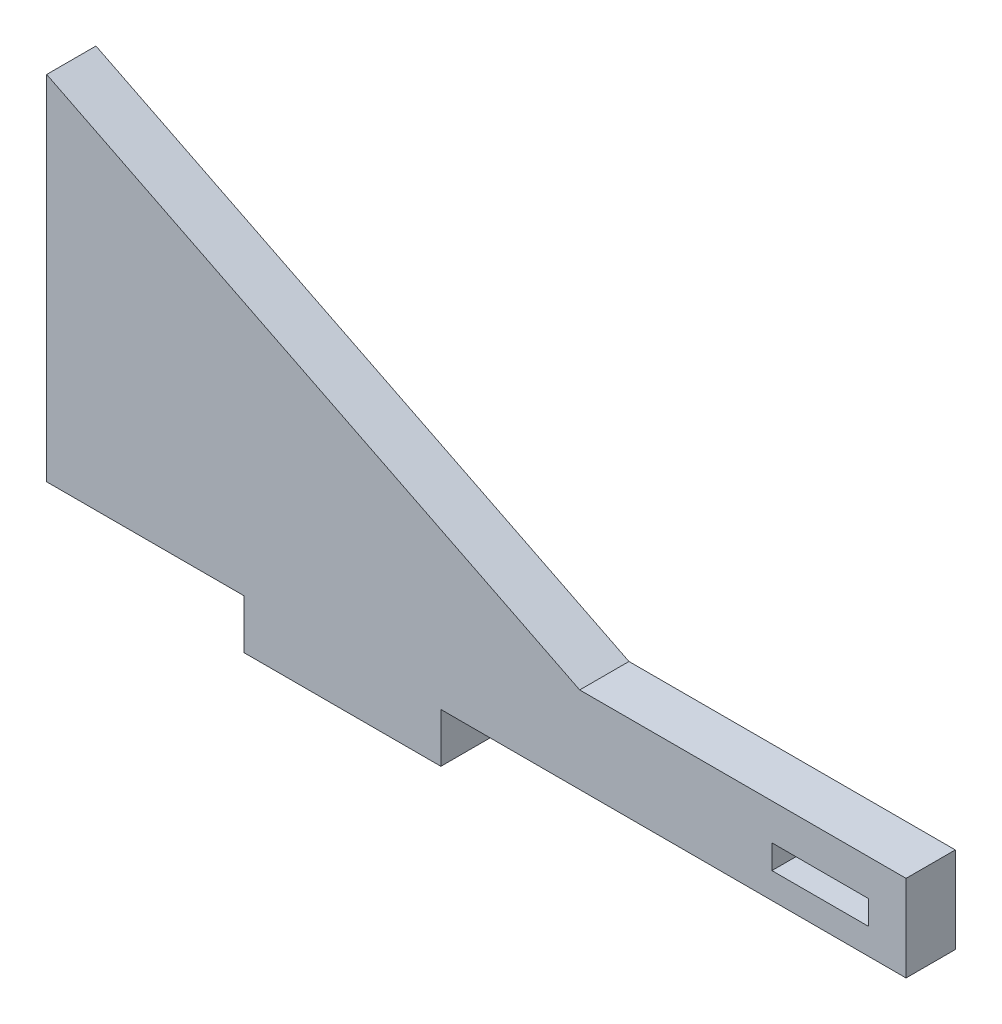
ISO-10303-21;
HEADER;
FILE_DESCRIPTION(('STEP AP214'),'2;1');
FILE_NAME('part.step','',(''),(''),'','','');
FILE_SCHEMA(('AUTOMOTIVE_DESIGN { 1 0 10303 214 1 1 1 1 }'));
ENDSEC;
DATA;
#1=APPLICATION_CONTEXT('core data for automotive mechanical design processes');
#2=APPLICATION_PROTOCOL_DEFINITION('international standard','automotive_design',2000,#1);
#3=PRODUCT_CONTEXT('',#1,'mechanical');
#4=PRODUCT('Part','Part','',(#3));
#5=PRODUCT_RELATED_PRODUCT_CATEGORY('part','',(#4));
#6=PRODUCT_DEFINITION_FORMATION('','',#4);
#7=PRODUCT_DEFINITION_CONTEXT('part definition',#1,'design');
#8=PRODUCT_DEFINITION('design','',#6,#7);
#9=PRODUCT_DEFINITION_SHAPE('','',#8);
#10=(LENGTH_UNIT() NAMED_UNIT(*) SI_UNIT(.MILLI.,.METRE.));
#11=(NAMED_UNIT(*) PLANE_ANGLE_UNIT() SI_UNIT($,.RADIAN.));
#12=(NAMED_UNIT(*) SI_UNIT($,.STERADIAN.) SOLID_ANGLE_UNIT());
#13=UNCERTAINTY_MEASURE_WITH_UNIT(LENGTH_MEASURE(1.E-05),#10,'distance_accuracy_value','');
#14=(GEOMETRIC_REPRESENTATION_CONTEXT(3) GLOBAL_UNCERTAINTY_ASSIGNED_CONTEXT((#13)) GLOBAL_UNIT_ASSIGNED_CONTEXT((#10,
#11,#12)) REPRESENTATION_CONTEXT('',''));
#15=CARTESIAN_POINT('',(0.,0.,0.));
#16=DIRECTION('',(0.,0.,1.));
#17=DIRECTION('',(1.,0.,0.));
#18=AXIS2_PLACEMENT_3D('',#15,#16,#17);
#19=CARTESIAN_POINT('',(-38.1,25.4,6.35));
#20=DIRECTION('',(1.,0.,0.));
#21=DIRECTION('',(0.,1.,0.));
#22=AXIS2_PLACEMENT_3D('',#19,#20,#21);
#23=PLANE('',#22);
#24=DIRECTION('',(0.,-1.,0.));
#25=VECTOR('',#24,1.);
#26=CARTESIAN_POINT('',(-38.1,25.4,0.));
#27=LINE('',#26,#25);
#28=CARTESIAN_POINT('',(-38.1,25.4,0.));
#29=VERTEX_POINT('',#28);
#30=CARTESIAN_POINT('',(-38.1,-20.066,0.));
#31=VERTEX_POINT('',#30);
#32=EDGE_CURVE('E177',#29,#31,#27,.T.);
#33=ORIENTED_EDGE('',*,*,#32,.T.);
#34=DIRECTION('',(0.,0.,-1.));
#35=VECTOR('',#34,1.);
#36=CARTESIAN_POINT('',(-38.1,-20.066,6.35));
#37=LINE('',#36,#35);
#38=CARTESIAN_POINT('',(-38.1,-20.066,6.35));
#39=VERTEX_POINT('',#38);
#40=EDGE_CURVE('E11',#39,#31,#37,.T.);
#41=ORIENTED_EDGE('',*,*,#40,.F.);
#42=DIRECTION('',(0.,-1.,0.));
#43=VECTOR('',#42,1.);
#44=CARTESIAN_POINT('',(-38.1,25.4,6.35));
#45=LINE('',#44,#43);
#46=CARTESIAN_POINT('',(-38.1,25.4,6.35));
#47=VERTEX_POINT('',#46);
#48=EDGE_CURVE('E182',#47,#39,#45,.T.);
#49=ORIENTED_EDGE('',*,*,#48,.F.);
#50=DIRECTION('',(0.,0.,-1.));
#51=VECTOR('',#50,1.);
#52=CARTESIAN_POINT('',(-38.1,25.4,6.35));
#53=LINE('',#52,#51);
#54=EDGE_CURVE('E198',#47,#29,#53,.T.);
#55=ORIENTED_EDGE('',*,*,#54,.T.);
#56=EDGE_LOOP('',(#33,#41,#49,#55));
#57=FACE_BOUND('',#56,.T.);
#58=ADVANCED_FACE('F32',(#57),#23,.F.);
#59=CARTESIAN_POINT('',(-38.1,-20.066,6.35));
#60=DIRECTION('',(0.,1.,0.));
#61=DIRECTION('',(0.,0.,1.));
#62=AXIS2_PLACEMENT_3D('',#59,#60,#61);
#63=PLANE('',#62);
#64=DIRECTION('',(1.,0.,0.));
#65=VECTOR('',#64,1.);
#66=CARTESIAN_POINT('',(-38.1,-20.066,0.));
#67=LINE('',#66,#65);
#68=CARTESIAN_POINT('',(-12.7,-20.066,0.));
#69=VERTEX_POINT('',#68);
#70=EDGE_CURVE('E201',#31,#69,#67,.T.);
#71=ORIENTED_EDGE('',*,*,#70,.T.);
#72=DIRECTION('',(0.,0.,-1.));
#73=VECTOR('',#72,1.);
#74=CARTESIAN_POINT('',(-12.7,-20.066,6.35));
#75=LINE('',#74,#73);
#76=CARTESIAN_POINT('',(-12.7,-20.066,6.35));
#77=VERTEX_POINT('',#76);
#78=EDGE_CURVE('E39',#77,#69,#75,.T.);
#79=ORIENTED_EDGE('',*,*,#78,.F.);
#80=DIRECTION('',(1.,0.,0.));
#81=VECTOR('',#80,1.);
#82=CARTESIAN_POINT('',(-38.1,-20.066,6.35));
#83=LINE('',#82,#81);
#84=EDGE_CURVE('E185',#39,#77,#83,.T.);
#85=ORIENTED_EDGE('',*,*,#84,.F.);
#86=ORIENTED_EDGE('',*,*,#40,.T.);
#87=EDGE_LOOP('',(#71,#79,#85,#86));
#88=FACE_BOUND('',#87,.T.);
#89=ADVANCED_FACE('F248',(#88),#63,.F.);
#90=CARTESIAN_POINT('',(-12.7,-20.066,6.35));
#91=DIRECTION('',(1.,0.,0.));
#92=DIRECTION('',(0.,1.,0.));
#93=AXIS2_PLACEMENT_3D('',#90,#91,#92);
#94=PLANE('',#93);
#95=DIRECTION('',(0.,-1.,0.));
#96=VECTOR('',#95,1.);
#97=CARTESIAN_POINT('',(-12.7,-20.066,0.));
#98=LINE('',#97,#96);
#99=CARTESIAN_POINT('',(-12.7,-26.416,0.));
#100=VERTEX_POINT('',#99);
#101=EDGE_CURVE('E203',#69,#100,#98,.T.);
#102=ORIENTED_EDGE('',*,*,#101,.T.);
#103=DIRECTION('',(0.,0.,-1.));
#104=VECTOR('',#103,1.);
#105=CARTESIAN_POINT('',(-12.7,-26.416,6.35));
#106=LINE('',#105,#104);
#107=CARTESIAN_POINT('',(-12.7,-26.416,6.35));
#108=VERTEX_POINT('',#107);
#109=EDGE_CURVE('E220',#108,#100,#106,.T.);
#110=ORIENTED_EDGE('',*,*,#109,.F.);
#111=DIRECTION('',(0.,-1.,0.));
#112=VECTOR('',#111,1.);
#113=CARTESIAN_POINT('',(-12.7,-20.066,6.35));
#114=LINE('',#113,#112);
#115=EDGE_CURVE('E188',#77,#108,#114,.T.);
#116=ORIENTED_EDGE('',*,*,#115,.F.);
#117=ORIENTED_EDGE('',*,*,#78,.T.);
#118=EDGE_LOOP('',(#102,#110,#116,#117));
#119=FACE_BOUND('',#118,.T.);
#120=ADVANCED_FACE('F227',(#119),#94,.F.);
#121=CARTESIAN_POINT('',(12.7,-26.416,6.35));
#122=DIRECTION('',(0.,1.,0.));
#123=DIRECTION('',(0.,0.,1.));
#124=AXIS2_PLACEMENT_3D('',#121,#122,#123);
#125=PLANE('',#124);
#126=DIRECTION('',(1.,0.,0.));
#127=VECTOR('',#126,1.);
#128=CARTESIAN_POINT('',(12.7,-26.416,0.));
#129=LINE('',#128,#127);
#130=CARTESIAN_POINT('',(12.7,-26.416,0.));
#131=VERTEX_POINT('',#130);
#132=EDGE_CURVE('E205',#100,#131,#129,.T.);
#133=ORIENTED_EDGE('',*,*,#132,.T.);
#134=DIRECTION('',(0.,0.,-1.));
#135=VECTOR('',#134,1.);
#136=CARTESIAN_POINT('',(12.7,-26.416,6.35));
#137=LINE('',#136,#135);
#138=CARTESIAN_POINT('',(12.7,-26.416,6.35));
#139=VERTEX_POINT('',#138);
#140=EDGE_CURVE('E217',#139,#131,#137,.T.);
#141=ORIENTED_EDGE('',*,*,#140,.F.);
#142=DIRECTION('',(1.,0.,0.));
#143=VECTOR('',#142,1.);
#144=CARTESIAN_POINT('',(12.7,-26.416,6.35));
#145=LINE('',#144,#143);
#146=EDGE_CURVE('E190',#108,#139,#145,.T.);
#147=ORIENTED_EDGE('',*,*,#146,.F.);
#148=ORIENTED_EDGE('',*,*,#109,.T.);
#149=EDGE_LOOP('',(#133,#141,#147,#148));
#150=FACE_BOUND('',#149,.T.);
#151=ADVANCED_FACE('F238',(#150),#125,.F.);
#152=CARTESIAN_POINT('',(12.7,-20.066,6.35));
#153=DIRECTION('',(-1.,0.,0.));
#154=DIRECTION('',(0.,-1.,0.));
#155=AXIS2_PLACEMENT_3D('',#152,#153,#154);
#156=PLANE('',#155);
#157=DIRECTION('',(0.,1.,0.));
#158=VECTOR('',#157,1.);
#159=CARTESIAN_POINT('',(12.7,-20.066,0.));
#160=LINE('',#159,#158);
#161=CARTESIAN_POINT('',(12.7,-20.066,0.));
#162=VERTEX_POINT('',#161);
#163=EDGE_CURVE('E207',#131,#162,#160,.T.);
#164=ORIENTED_EDGE('',*,*,#163,.T.);
#165=DIRECTION('',(0.,0.,-1.));
#166=VECTOR('',#165,1.);
#167=CARTESIAN_POINT('',(12.7,-20.066,6.35));
#168=LINE('',#167,#166);
#169=CARTESIAN_POINT('',(12.7,-20.066,6.35));
#170=VERTEX_POINT('',#169);
#171=EDGE_CURVE('E214',#170,#162,#168,.T.);
#172=ORIENTED_EDGE('',*,*,#171,.F.);
#173=DIRECTION('',(0.,1.,0.));
#174=VECTOR('',#173,1.);
#175=CARTESIAN_POINT('',(12.7,-20.066,6.35));
#176=LINE('',#175,#174);
#177=EDGE_CURVE('E192',#139,#170,#176,.T.);
#178=ORIENTED_EDGE('',*,*,#177,.F.);
#179=ORIENTED_EDGE('',*,*,#140,.T.);
#180=EDGE_LOOP('',(#164,#172,#178,#179));
#181=FACE_BOUND('',#180,.T.);
#182=ADVANCED_FACE('F242',(#181),#156,.F.);
#183=CARTESIAN_POINT('',(12.7,-20.066,6.35));
#184=DIRECTION('',(0.,1.,0.));
#185=DIRECTION('',(0.,0.,1.));
#186=AXIS2_PLACEMENT_3D('',#183,#184,#185);
#187=PLANE('',#186);
#188=DIRECTION('',(1.,0.,0.));
#189=VECTOR('',#188,1.);
#190=CARTESIAN_POINT('',(12.7,-20.066,0.));
#191=LINE('',#190,#189);
#192=CARTESIAN_POINT('',(72.644,-20.066,0.));
#193=VERTEX_POINT('',#192);
#194=EDGE_CURVE('E209',#162,#193,#191,.T.);
#195=ORIENTED_EDGE('',*,*,#194,.T.);
#196=DIRECTION('',(0.,0.,1.));
#197=VECTOR('',#196,1.);
#198=CARTESIAN_POINT('',(72.644,-20.066,0.));
#199=LINE('',#198,#197);
#200=CARTESIAN_POINT('',(72.644,-20.066,6.35));
#201=VERTEX_POINT('',#200);
#202=EDGE_CURVE('E169',#193,#201,#199,.T.);
#203=ORIENTED_EDGE('',*,*,#202,.T.);
#204=DIRECTION('',(1.,0.,0.));
#205=VECTOR('',#204,1.);
#206=CARTESIAN_POINT('',(12.7,-20.066,6.35));
#207=LINE('',#206,#205);
#208=EDGE_CURVE('E194',#170,#201,#207,.T.);
#209=ORIENTED_EDGE('',*,*,#208,.F.);
#210=ORIENTED_EDGE('',*,*,#171,.T.);
#211=EDGE_LOOP('',(#195,#203,#209,#210));
#212=FACE_BOUND('',#211,.T.);
#213=ADVANCED_FACE('F264',(#212),#187,.F.);
#214=CARTESIAN_POINT('',(-38.1,25.4,6.35));
#215=DIRECTION('',(-0.447213595499958,-0.894427190999916,0.));
#216=DIRECTION('',(0.894427190999916,-0.447213595499958,0.));
#217=AXIS2_PLACEMENT_3D('',#214,#215,#216);
#218=PLANE('',#217);
#219=DIRECTION('',(-0.894427190999916,0.447213595499958,0.));
#220=VECTOR('',#219,1.);
#221=CARTESIAN_POINT('',(-38.1,25.4,6.35));
#222=LINE('',#221,#220);
#223=CARTESIAN_POINT('',(30.588537433123,-8.94426871656152,6.35));
#224=VERTEX_POINT('',#223);
#225=EDGE_CURVE('E196',#224,#47,#222,.T.);
#226=ORIENTED_EDGE('',*,*,#225,.F.);
#227=DIRECTION('',(0.,0.,1.));
#228=VECTOR('',#227,1.);
#229=CARTESIAN_POINT('',(30.5885374331231,-8.94426871656151,0.));
#230=LINE('',#229,#228);
#231=CARTESIAN_POINT('',(30.5885374331231,-8.94426871656151,0.));
#232=VERTEX_POINT('',#231);
#233=EDGE_CURVE('E174',#232,#224,#230,.T.);
#234=ORIENTED_EDGE('',*,*,#233,.F.);
#235=DIRECTION('',(-0.894427190999916,0.447213595499958,0.));
#236=VECTOR('',#235,1.);
#237=CARTESIAN_POINT('',(-38.1,25.4,0.));
#238=LINE('',#237,#236);
#239=EDGE_CURVE('E186',#232,#29,#238,.T.);
#240=ORIENTED_EDGE('',*,*,#239,.T.);
#241=ORIENTED_EDGE('',*,*,#54,.F.);
#242=EDGE_LOOP('',(#226,#234,#240,#241));
#243=FACE_BOUND('',#242,.T.);
#244=ADVANCED_FACE('F255',(#243),#218,.F.);
#245=CARTESIAN_POINT('',(-38.1,-20.066,6.35));
#246=DIRECTION('',(0.,0.,1.));
#247=DIRECTION('',(1.,0.,0.));
#248=AXIS2_PLACEMENT_3D('',#245,#246,#247);
#249=PLANE('',#248);
#250=DIRECTION('',(0.,-1.,0.));
#251=VECTOR('',#250,1.);
#252=CARTESIAN_POINT('',(67.7758241726849,-16.7235443464116,6.35));
#253=LINE('',#252,#251);
#254=CARTESIAN_POINT('',(67.7758241726849,-13.6212454686131,6.35));
#255=VERTEX_POINT('',#254);
#256=CARTESIAN_POINT('',(67.7758241726849,-16.7235443464116,6.35));
#257=VERTEX_POINT('',#256);
#258=EDGE_CURVE('E128',#255,#257,#253,.T.);
#259=ORIENTED_EDGE('',*,*,#258,.T.);
#260=DIRECTION('',(-1.,0.,0.));
#261=VECTOR('',#260,1.);
#262=CARTESIAN_POINT('',(67.7758241726849,-16.7235443464116,6.35));
#263=LINE('',#262,#261);
#264=CARTESIAN_POINT('',(55.3561243607419,-16.7235443464116,6.35));
#265=VERTEX_POINT('',#264);
#266=EDGE_CURVE('E137',#257,#265,#263,.T.);
#267=ORIENTED_EDGE('',*,*,#266,.T.);
#268=DIRECTION('',(0.,1.,0.));
#269=VECTOR('',#268,1.);
#270=CARTESIAN_POINT('',(55.3561243607419,-16.7235443464116,6.35));
#271=LINE('',#270,#269);
#272=CARTESIAN_POINT('',(55.3561243607419,-13.6212454686131,6.35));
#273=VERTEX_POINT('',#272);
#274=EDGE_CURVE('E46',#265,#273,#271,.T.);
#275=ORIENTED_EDGE('',*,*,#274,.T.);
#276=DIRECTION('',(1.,0.,0.));
#277=VECTOR('',#276,1.);
#278=CARTESIAN_POINT('',(67.7758241726849,-13.6212454686131,6.35));
#279=LINE('',#278,#277);
#280=EDGE_CURVE('E134',#273,#255,#279,.T.);
#281=ORIENTED_EDGE('',*,*,#280,.T.);
#282=EDGE_LOOP('',(#259,#267,#275,#281));
#283=FACE_BOUND('',#282,.T.);
#284=ORIENTED_EDGE('',*,*,#48,.T.);
#285=ORIENTED_EDGE('',*,*,#84,.T.);
#286=ORIENTED_EDGE('',*,*,#115,.T.);
#287=ORIENTED_EDGE('',*,*,#146,.T.);
#288=ORIENTED_EDGE('',*,*,#177,.T.);
#289=ORIENTED_EDGE('',*,*,#208,.T.);
#290=DIRECTION('',(0.,1.,0.));
#291=VECTOR('',#290,1.);
#292=CARTESIAN_POINT('',(72.644,-12.7,6.35));
#293=LINE('',#292,#291);
#294=CARTESIAN_POINT('',(72.644,-8.94426871656151,6.35));
#295=VERTEX_POINT('',#294);
#296=EDGE_CURVE('E159',#201,#295,#293,.T.);
#297=ORIENTED_EDGE('',*,*,#296,.T.);
#298=DIRECTION('',(-1.,0.,0.));
#299=VECTOR('',#298,1.);
#300=CARTESIAN_POINT('',(30.5885374331231,-8.94426871656151,6.35));
#301=LINE('',#300,#299);
#302=EDGE_CURVE('E166',#295,#224,#301,.T.);
#303=ORIENTED_EDGE('',*,*,#302,.T.);
#304=ORIENTED_EDGE('',*,*,#225,.T.);
#305=EDGE_LOOP('',(#284,#285,#286,#287,#288,#289,#297,#303,#304));
#306=FACE_BOUND('',#305,.T.);
#307=ADVANCED_FACE('F141',(#283,#306),#249,.T.);
#308=CARTESIAN_POINT('',(-38.1,-20.066,0.));
#309=DIRECTION('',(0.,0.,1.));
#310=DIRECTION('',(1.,0.,0.));
#311=AXIS2_PLACEMENT_3D('',#308,#309,#310);
#312=PLANE('',#311);
#313=DIRECTION('',(-1.,0.,0.));
#314=VECTOR('',#313,1.);
#315=CARTESIAN_POINT('',(67.7758241726849,-16.7235443464116,0.));
#316=LINE('',#315,#314);
#317=CARTESIAN_POINT('',(67.7758241726849,-16.7235443464116,0.));
#318=VERTEX_POINT('',#317);
#319=CARTESIAN_POINT('',(55.3561243607419,-16.7235443464116,0.));
#320=VERTEX_POINT('',#319);
#321=EDGE_CURVE('E153',#318,#320,#316,.T.);
#322=ORIENTED_EDGE('',*,*,#321,.F.);
#323=DIRECTION('',(0.,-1.,0.));
#324=VECTOR('',#323,1.);
#325=CARTESIAN_POINT('',(67.7758241726849,-16.7235443464116,0.));
#326=LINE('',#325,#324);
#327=CARTESIAN_POINT('',(67.7758241726849,-13.6212454686131,0.));
#328=VERTEX_POINT('',#327);
#329=EDGE_CURVE('E54',#328,#318,#326,.T.);
#330=ORIENTED_EDGE('',*,*,#329,.F.);
#331=DIRECTION('',(1.,0.,0.));
#332=VECTOR('',#331,1.);
#333=CARTESIAN_POINT('',(67.7758241726849,-13.6212454686131,0.));
#334=LINE('',#333,#332);
#335=CARTESIAN_POINT('',(55.3561243607419,-13.6212454686131,0.));
#336=VERTEX_POINT('',#335);
#337=EDGE_CURVE('E144',#336,#328,#334,.T.);
#338=ORIENTED_EDGE('',*,*,#337,.F.);
#339=DIRECTION('',(0.,1.,0.));
#340=VECTOR('',#339,1.);
#341=CARTESIAN_POINT('',(55.3561243607419,-16.7235443464116,0.));
#342=LINE('',#341,#340);
#343=EDGE_CURVE('E147',#320,#336,#342,.T.);
#344=ORIENTED_EDGE('',*,*,#343,.F.);
#345=EDGE_LOOP('',(#322,#330,#338,#344));
#346=FACE_BOUND('',#345,.T.);
#347=ORIENTED_EDGE('',*,*,#32,.F.);
#348=ORIENTED_EDGE('',*,*,#239,.F.);
#349=DIRECTION('',(-1.,0.,0.));
#350=VECTOR('',#349,1.);
#351=CARTESIAN_POINT('',(30.5885374331231,-8.94426871656151,0.));
#352=LINE('',#351,#350);
#353=CARTESIAN_POINT('',(72.644,-8.94426871656151,0.));
#354=VERTEX_POINT('',#353);
#355=EDGE_CURVE('E165',#354,#232,#352,.T.);
#356=ORIENTED_EDGE('',*,*,#355,.F.);
#357=DIRECTION('',(0.,1.,0.));
#358=VECTOR('',#357,1.);
#359=CARTESIAN_POINT('',(72.644,-20.066,0.));
#360=LINE('',#359,#358);
#361=EDGE_CURVE('E163',#193,#354,#360,.T.);
#362=ORIENTED_EDGE('',*,*,#361,.F.);
#363=ORIENTED_EDGE('',*,*,#194,.F.);
#364=ORIENTED_EDGE('',*,*,#163,.F.);
#365=ORIENTED_EDGE('',*,*,#132,.F.);
#366=ORIENTED_EDGE('',*,*,#101,.F.);
#367=ORIENTED_EDGE('',*,*,#70,.F.);
#368=EDGE_LOOP('',(#347,#348,#356,#362,#363,#364,#365,#366,#367));
#369=FACE_BOUND('',#368,.T.);
#370=ADVANCED_FACE('F233',(#346,#369),#312,.F.);
#371=CARTESIAN_POINT('',(30.5885374331231,-8.94426871656151,0.));
#372=DIRECTION('',(0.,1.,0.));
#373=DIRECTION('',(-1.,0.,0.));
#374=AXIS2_PLACEMENT_3D('',#371,#372,#373);
#375=PLANE('',#374);
#376=ORIENTED_EDGE('',*,*,#302,.F.);
#377=DIRECTION('',(0.,0.,1.));
#378=VECTOR('',#377,1.);
#379=CARTESIAN_POINT('',(72.644,-8.94426871656151,0.));
#380=LINE('',#379,#378);
#381=EDGE_CURVE('E178',#354,#295,#380,.T.);
#382=ORIENTED_EDGE('',*,*,#381,.F.);
#383=ORIENTED_EDGE('',*,*,#355,.T.);
#384=ORIENTED_EDGE('',*,*,#233,.T.);
#385=EDGE_LOOP('',(#376,#382,#383,#384));
#386=FACE_BOUND('',#385,.T.);
#387=ADVANCED_FACE('F259',(#386),#375,.T.);
#388=CARTESIAN_POINT('',(72.644,-12.7,0.));
#389=DIRECTION('',(1.,0.,0.));
#390=DIRECTION('',(0.,0.,-1.));
#391=AXIS2_PLACEMENT_3D('',#388,#389,#390);
#392=PLANE('',#391);
#393=ORIENTED_EDGE('',*,*,#296,.F.);
#394=ORIENTED_EDGE('',*,*,#202,.F.);
#395=ORIENTED_EDGE('',*,*,#361,.T.);
#396=ORIENTED_EDGE('',*,*,#381,.T.);
#397=EDGE_LOOP('',(#393,#394,#395,#396));
#398=FACE_BOUND('',#397,.T.);
#399=ADVANCED_FACE('F261',(#398),#392,.T.);
#400=CARTESIAN_POINT('',(67.7758241726849,-16.7235443464116,6.35));
#401=DIRECTION('',(1.,0.,0.));
#402=DIRECTION('',(0.,0.,-1.));
#403=AXIS2_PLACEMENT_3D('',#400,#401,#402);
#404=PLANE('',#403);
#405=ORIENTED_EDGE('',*,*,#329,.T.);
#406=DIRECTION('',(0.,0.,-1.));
#407=VECTOR('',#406,1.);
#408=CARTESIAN_POINT('',(67.7758241726849,-16.7235443464116,6.35));
#409=LINE('',#408,#407);
#410=EDGE_CURVE('E124',#257,#318,#409,.T.);
#411=ORIENTED_EDGE('',*,*,#410,.F.);
#412=ORIENTED_EDGE('',*,*,#258,.F.);
#413=DIRECTION('',(0.,0.,-1.));
#414=VECTOR('',#413,1.);
#415=CARTESIAN_POINT('',(67.7758241726849,-13.6212454686131,6.35));
#416=LINE('',#415,#414);
#417=EDGE_CURVE('E157',#255,#328,#416,.T.);
#418=ORIENTED_EDGE('',*,*,#417,.T.);
#419=EDGE_LOOP('',(#405,#411,#412,#418));
#420=FACE_BOUND('',#419,.T.);
#421=ADVANCED_FACE('F126',(#420),#404,.F.);
#422=CARTESIAN_POINT('',(67.7758241726849,-13.6212454686131,6.35));
#423=DIRECTION('',(0.,1.,0.));
#424=DIRECTION('',(0.,0.,1.));
#425=AXIS2_PLACEMENT_3D('',#422,#423,#424);
#426=PLANE('',#425);
#427=ORIENTED_EDGE('',*,*,#337,.T.);
#428=ORIENTED_EDGE('',*,*,#417,.F.);
#429=ORIENTED_EDGE('',*,*,#280,.F.);
#430=DIRECTION('',(0.,0.,-1.));
#431=VECTOR('',#430,1.);
#432=CARTESIAN_POINT('',(55.3561243607419,-13.6212454686131,6.35));
#433=LINE('',#432,#431);
#434=EDGE_CURVE('E160',#273,#336,#433,.T.);
#435=ORIENTED_EDGE('',*,*,#434,.T.);
#436=EDGE_LOOP('',(#427,#428,#429,#435));
#437=FACE_BOUND('',#436,.T.);
#438=ADVANCED_FACE('F347',(#437),#426,.F.);
#439=CARTESIAN_POINT('',(55.3561243607419,-16.7235443464116,6.35));
#440=DIRECTION('',(-1.,0.,0.));
#441=DIRECTION('',(0.,0.,1.));
#442=AXIS2_PLACEMENT_3D('',#439,#440,#441);
#443=PLANE('',#442);
#444=ORIENTED_EDGE('',*,*,#343,.T.);
#445=ORIENTED_EDGE('',*,*,#434,.F.);
#446=ORIENTED_EDGE('',*,*,#274,.F.);
#447=DIRECTION('',(0.,0.,-1.));
#448=VECTOR('',#447,1.);
#449=CARTESIAN_POINT('',(55.3561243607419,-16.7235443464116,6.35));
#450=LINE('',#449,#448);
#451=EDGE_CURVE('E133',#265,#320,#450,.T.);
#452=ORIENTED_EDGE('',*,*,#451,.T.);
#453=EDGE_LOOP('',(#444,#445,#446,#452));
#454=FACE_BOUND('',#453,.T.);
#455=ADVANCED_FACE('F356',(#454),#443,.F.);
#456=CARTESIAN_POINT('',(67.7758241726849,-16.7235443464116,6.35));
#457=DIRECTION('',(0.,-1.,0.));
#458=DIRECTION('',(0.,0.,-1.));
#459=AXIS2_PLACEMENT_3D('',#456,#457,#458);
#460=PLANE('',#459);
#461=ORIENTED_EDGE('',*,*,#321,.T.);
#462=ORIENTED_EDGE('',*,*,#451,.F.);
#463=ORIENTED_EDGE('',*,*,#266,.F.);
#464=ORIENTED_EDGE('',*,*,#410,.T.);
#465=EDGE_LOOP('',(#461,#462,#463,#464));
#466=FACE_BOUND('',#465,.T.);
#467=ADVANCED_FACE('F138',(#466),#460,.F.);
#468=CLOSED_SHELL('',(#58,#89,#120,#151,#182,#213,#244,#307,#370,#387,#399,#421,#438,#455,#467));
#469=MANIFOLD_SOLID_BREP('B2',#468);
#470=ADVANCED_BREP_SHAPE_REPRESENTATION('',(#18,#469),#14);
#471=SHAPE_DEFINITION_REPRESENTATION(#9,#470);
ENDSEC;
END-ISO-10303-21;
